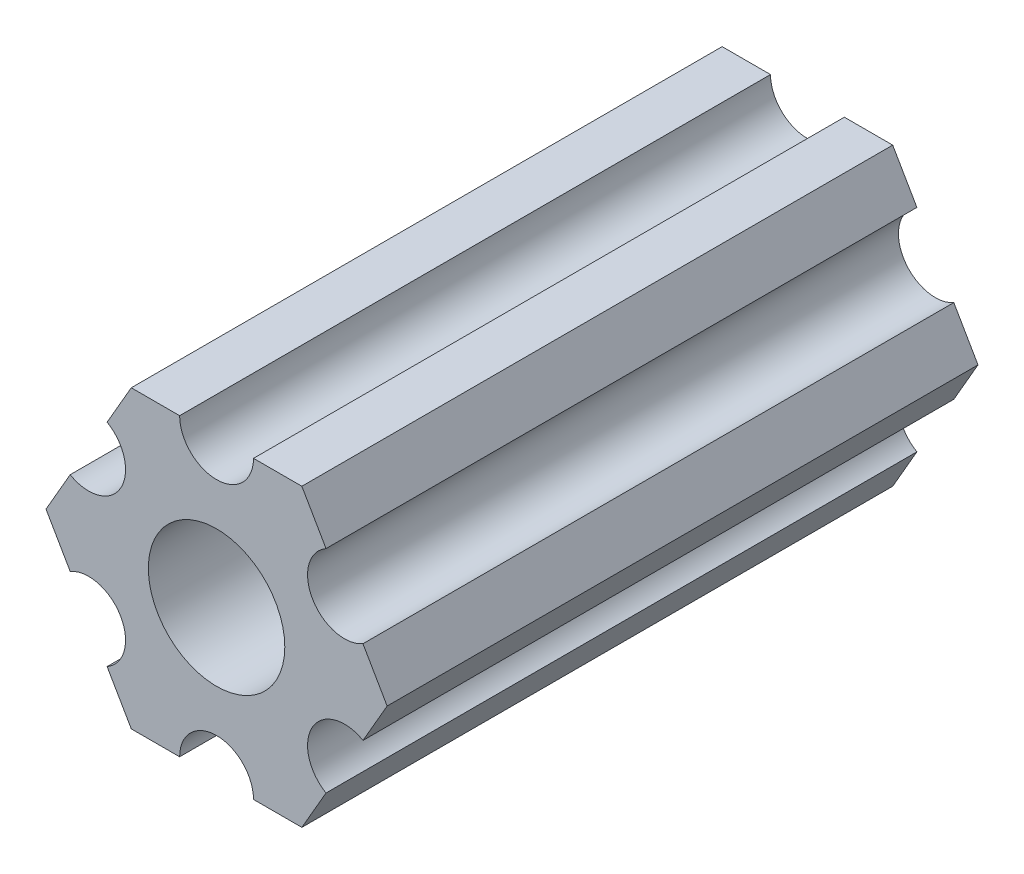
ISO-10303-21;
HEADER;
FILE_DESCRIPTION(('STEP AP214'),'2;1');
FILE_NAME('part.step','',(''),(''),'','','');
FILE_SCHEMA(('AUTOMOTIVE_DESIGN { 1 0 10303 214 1 1 1 1 }'));
ENDSEC;
DATA;
#1=APPLICATION_CONTEXT('core data for automotive mechanical design processes');
#2=APPLICATION_PROTOCOL_DEFINITION('international standard','automotive_design',2000,#1);
#3=PRODUCT_CONTEXT('',#1,'mechanical');
#4=PRODUCT('Part','Part','',(#3));
#5=PRODUCT_RELATED_PRODUCT_CATEGORY('part','',(#4));
#6=PRODUCT_DEFINITION_FORMATION('','',#4);
#7=PRODUCT_DEFINITION_CONTEXT('part definition',#1,'design');
#8=PRODUCT_DEFINITION('design','',#6,#7);
#9=PRODUCT_DEFINITION_SHAPE('','',#8);
#10=(LENGTH_UNIT() NAMED_UNIT(*) SI_UNIT(.MILLI.,.METRE.));
#11=(NAMED_UNIT(*) PLANE_ANGLE_UNIT() SI_UNIT($,.RADIAN.));
#12=(NAMED_UNIT(*) SI_UNIT($,.STERADIAN.) SOLID_ANGLE_UNIT());
#13=UNCERTAINTY_MEASURE_WITH_UNIT(LENGTH_MEASURE(1.E-05),#10,'distance_accuracy_value','');
#14=(GEOMETRIC_REPRESENTATION_CONTEXT(3) GLOBAL_UNCERTAINTY_ASSIGNED_CONTEXT((#13)) GLOBAL_UNIT_ASSIGNED_CONTEXT((#10,
#11,#12)) REPRESENTATION_CONTEXT('',''));
#15=CARTESIAN_POINT('',(0.,0.,0.));
#16=DIRECTION('',(0.,0.,1.));
#17=DIRECTION('',(1.,0.,0.));
#18=AXIS2_PLACEMENT_3D('',#15,#16,#17);
#19=CARTESIAN_POINT('',(4.70551131403118,4.5498153285078,-25.4));
#20=DIRECTION('',(0.866025403784438,0.500000000000001,0.));
#21=DIRECTION('',(-0.500000000000001,0.866025403784438,0.));
#22=AXIS2_PLACEMENT_3D('',#19,#20,#21);
#23=PLANE('',#22);
#24=DIRECTION('',(-0.500000000000001,0.866025403784438,0.));
#25=VECTOR('',#24,1.);
#26=CARTESIAN_POINT('',(4.70551131403118,4.5498153285078,0.));
#27=LINE('',#26,#25);
#28=CARTESIAN_POINT('',(4.70551131403118,4.5498153285078,0.));
#29=VERTEX_POINT('',#28);
#30=CARTESIAN_POINT('',(3.66617420935412,6.35,0.));
#31=VERTEX_POINT('',#30);
#32=EDGE_CURVE('E198',#29,#31,#27,.T.);
#33=ORIENTED_EDGE('',*,*,#32,.F.);
#34=DIRECTION('',(0.,0.,1.));
#35=VECTOR('',#34,1.);
#36=CARTESIAN_POINT('',(4.70551131403118,4.5498153285078,-25.4));
#37=LINE('',#36,#35);
#38=CARTESIAN_POINT('',(4.70551131403118,4.5498153285078,-25.4));
#39=VERTEX_POINT('',#38);
#40=EDGE_CURVE('E11',#39,#29,#37,.T.);
#41=ORIENTED_EDGE('',*,*,#40,.F.);
#42=DIRECTION('',(-0.500000000000001,0.866025403784438,0.));
#43=VECTOR('',#42,1.);
#44=CARTESIAN_POINT('',(4.70551131403118,4.5498153285078,-25.4));
#45=LINE('',#44,#43);
#46=CARTESIAN_POINT('',(3.66617420935412,6.35,-25.4));
#47=VERTEX_POINT('',#46);
#48=EDGE_CURVE('E249',#39,#47,#45,.T.);
#49=ORIENTED_EDGE('',*,*,#48,.T.);
#50=DIRECTION('',(0.,0.,1.));
#51=VECTOR('',#50,1.);
#52=CARTESIAN_POINT('',(3.66617420935412,6.35,-25.4));
#53=LINE('',#52,#51);
#54=EDGE_CURVE('E44',#47,#31,#53,.T.);
#55=ORIENTED_EDGE('',*,*,#54,.T.);
#56=EDGE_LOOP('',(#33,#41,#49,#55));
#57=FACE_BOUND('',#56,.T.);
#58=ADVANCED_FACE('F41',(#57),#23,.T.);
#59=CARTESIAN_POINT('',(5.49926131403118,3.175,-25.4));
#60=DIRECTION('',(0.,0.,1.));
#61=DIRECTION('',(1.,0.,0.));
#62=AXIS2_PLACEMENT_3D('',#59,#60,#61);
#63=CYLINDRICAL_SURFACE('',#62,1.5875);
#64=CARTESIAN_POINT('',(5.49926131403118,3.175,0.));
#65=DIRECTION('',(0.,0.,-1.));
#66=DIRECTION('',(1.,0.,0.));
#67=AXIS2_PLACEMENT_3D('',#64,#65,#66);
#68=CIRCLE('',#67,1.5875);
#69=CARTESIAN_POINT('',(6.29301131403118,1.8001846714922,0.));
#70=VERTEX_POINT('',#69);
#71=EDGE_CURVE('E247',#70,#29,#68,.T.);
#72=ORIENTED_EDGE('',*,*,#71,.F.);
#73=DIRECTION('',(0.,0.,1.));
#74=VECTOR('',#73,1.);
#75=CARTESIAN_POINT('',(6.29301131403118,1.8001846714922,-25.4));
#76=LINE('',#75,#74);
#77=CARTESIAN_POINT('',(6.29301131403118,1.8001846714922,-25.4));
#78=VERTEX_POINT('',#77);
#79=EDGE_CURVE('E50',#78,#70,#76,.T.);
#80=ORIENTED_EDGE('',*,*,#79,.F.);
#81=CARTESIAN_POINT('',(5.49926131403118,3.175,-25.4));
#82=DIRECTION('',(0.,0.,-1.));
#83=DIRECTION('',(1.,0.,0.));
#84=AXIS2_PLACEMENT_3D('',#81,#82,#83);
#85=CIRCLE('',#84,1.5875);
#86=EDGE_CURVE('E188',#78,#39,#85,.T.);
#87=ORIENTED_EDGE('',*,*,#86,.T.);
#88=ORIENTED_EDGE('',*,*,#40,.T.);
#89=EDGE_LOOP('',(#72,#80,#87,#88));
#90=FACE_BOUND('',#89,.T.);
#91=ADVANCED_FACE('F281',(#90),#63,.F.);
#92=CARTESIAN_POINT('',(7.33234841870824,0.,-25.4));
#93=DIRECTION('',(0.866025403784439,0.499999999999999,0.));
#94=DIRECTION('',(-0.499999999999999,0.866025403784439,0.));
#95=AXIS2_PLACEMENT_3D('',#92,#93,#94);
#96=PLANE('',#95);
#97=DIRECTION('',(-0.499999999999999,0.866025403784439,0.));
#98=VECTOR('',#97,1.);
#99=CARTESIAN_POINT('',(7.33234841870824,0.,0.));
#100=LINE('',#99,#98);
#101=CARTESIAN_POINT('',(7.33234841870824,0.,0.));
#102=VERTEX_POINT('',#101);
#103=EDGE_CURVE('E175',#102,#70,#100,.T.);
#104=ORIENTED_EDGE('',*,*,#103,.F.);
#105=DIRECTION('',(0.,0.,1.));
#106=VECTOR('',#105,1.);
#107=CARTESIAN_POINT('',(7.33234841870824,0.,-25.4));
#108=LINE('',#107,#106);
#109=CARTESIAN_POINT('',(7.33234841870824,0.,-25.4));
#110=VERTEX_POINT('',#109);
#111=EDGE_CURVE('E170',#110,#102,#108,.T.);
#112=ORIENTED_EDGE('',*,*,#111,.F.);
#113=DIRECTION('',(-0.499999999999999,0.866025403784439,0.));
#114=VECTOR('',#113,1.);
#115=CARTESIAN_POINT('',(7.33234841870824,0.,-25.4));
#116=LINE('',#115,#114);
#117=EDGE_CURVE('E173',#110,#78,#116,.T.);
#118=ORIENTED_EDGE('',*,*,#117,.T.);
#119=ORIENTED_EDGE('',*,*,#79,.T.);
#120=EDGE_LOOP('',(#104,#112,#118,#119));
#121=FACE_BOUND('',#120,.T.);
#122=ADVANCED_FACE('F172',(#121),#96,.T.);
#123=CARTESIAN_POINT('',(6.29301131403119,-1.8001846714922,-25.4));
#124=DIRECTION('',(0.866025403784439,-0.499999999999999,0.));
#125=DIRECTION('',(0.499999999999999,0.86602540378444,0.));
#126=AXIS2_PLACEMENT_3D('',#123,#124,#125);
#127=PLANE('',#126);
#128=DIRECTION('',(0.499999999999999,0.866025403784439,0.));
#129=VECTOR('',#128,1.);
#130=CARTESIAN_POINT('',(6.29301131403119,-1.8001846714922,0.));
#131=LINE('',#130,#129);
#132=CARTESIAN_POINT('',(6.29301131403119,-1.8001846714922,0.));
#133=VERTEX_POINT('',#132);
#134=EDGE_CURVE('E244',#133,#102,#131,.T.);
#135=ORIENTED_EDGE('',*,*,#134,.F.);
#136=DIRECTION('',(0.,0.,1.));
#137=VECTOR('',#136,1.);
#138=CARTESIAN_POINT('',(6.29301131403119,-1.8001846714922,-25.4));
#139=LINE('',#138,#137);
#140=CARTESIAN_POINT('',(6.29301131403119,-1.8001846714922,-25.4));
#141=VERTEX_POINT('',#140);
#142=EDGE_CURVE('E180',#141,#133,#139,.T.);
#143=ORIENTED_EDGE('',*,*,#142,.F.);
#144=DIRECTION('',(0.499999999999999,0.866025403784439,0.));
#145=VECTOR('',#144,1.);
#146=CARTESIAN_POINT('',(6.29301131403119,-1.8001846714922,-25.4));
#147=LINE('',#146,#145);
#148=EDGE_CURVE('E186',#141,#110,#147,.T.);
#149=ORIENTED_EDGE('',*,*,#148,.T.);
#150=ORIENTED_EDGE('',*,*,#111,.T.);
#151=EDGE_LOOP('',(#135,#143,#149,#150));
#152=FACE_BOUND('',#151,.T.);
#153=ADVANCED_FACE('F190',(#152),#127,.T.);
#154=CARTESIAN_POINT('',(5.49926131403118,-3.175,-25.4));
#155=DIRECTION('',(0.,0.,1.));
#156=DIRECTION('',(1.,0.,0.));
#157=AXIS2_PLACEMENT_3D('',#154,#155,#156);
#158=CYLINDRICAL_SURFACE('',#157,1.5875);
#159=CARTESIAN_POINT('',(5.49926131403118,-3.175,0.));
#160=DIRECTION('',(0.,0.,-1.));
#161=DIRECTION('',(1.,0.,0.));
#162=AXIS2_PLACEMENT_3D('',#159,#160,#161);
#163=CIRCLE('',#162,1.5875);
#164=CARTESIAN_POINT('',(4.70551131403118,-4.54981532850779,0.));
#165=VERTEX_POINT('',#164);
#166=EDGE_CURVE('E241',#165,#133,#163,.T.);
#167=ORIENTED_EDGE('',*,*,#166,.F.);
#168=DIRECTION('',(0.,0.,1.));
#169=VECTOR('',#168,1.);
#170=CARTESIAN_POINT('',(4.70551131403118,-4.54981532850779,-25.4));
#171=LINE('',#170,#169);
#172=CARTESIAN_POINT('',(4.70551131403118,-4.54981532850779,-25.4));
#173=VERTEX_POINT('',#172);
#174=EDGE_CURVE('E253',#173,#165,#171,.T.);
#175=ORIENTED_EDGE('',*,*,#174,.F.);
#176=CARTESIAN_POINT('',(5.49926131403118,-3.175,-25.4));
#177=DIRECTION('',(0.,0.,-1.));
#178=DIRECTION('',(1.,0.,0.));
#179=AXIS2_PLACEMENT_3D('',#176,#177,#178);
#180=CIRCLE('',#179,1.5875);
#181=EDGE_CURVE('E191',#173,#141,#180,.T.);
#182=ORIENTED_EDGE('',*,*,#181,.T.);
#183=ORIENTED_EDGE('',*,*,#142,.T.);
#184=EDGE_LOOP('',(#167,#175,#182,#183));
#185=FACE_BOUND('',#184,.T.);
#186=ADVANCED_FACE('F294',(#185),#158,.F.);
#187=CARTESIAN_POINT('',(3.66617420935412,-6.35,-25.4));
#188=DIRECTION('',(0.866025403784439,-0.499999999999998,0.));
#189=DIRECTION('',(0.499999999999999,0.86602540378444,0.));
#190=AXIS2_PLACEMENT_3D('',#187,#188,#189);
#191=PLANE('',#190);
#192=DIRECTION('',(0.499999999999998,0.866025403784439,0.));
#193=VECTOR('',#192,1.);
#194=CARTESIAN_POINT('',(3.66617420935412,-6.35,0.));
#195=LINE('',#194,#193);
#196=CARTESIAN_POINT('',(3.66617420935412,-6.35,0.));
#197=VERTEX_POINT('',#196);
#198=EDGE_CURVE('E238',#197,#165,#195,.T.);
#199=ORIENTED_EDGE('',*,*,#198,.F.);
#200=DIRECTION('',(0.,0.,1.));
#201=VECTOR('',#200,1.);
#202=CARTESIAN_POINT('',(3.66617420935412,-6.35,-25.4));
#203=LINE('',#202,#201);
#204=CARTESIAN_POINT('',(3.66617420935412,-6.35,-25.4));
#205=VERTEX_POINT('',#204);
#206=EDGE_CURVE('E255',#205,#197,#203,.T.);
#207=ORIENTED_EDGE('',*,*,#206,.F.);
#208=DIRECTION('',(0.499999999999998,0.866025403784439,0.));
#209=VECTOR('',#208,1.);
#210=CARTESIAN_POINT('',(3.66617420935412,-6.35,-25.4));
#211=LINE('',#210,#209);
#212=EDGE_CURVE('E193',#205,#173,#211,.T.);
#213=ORIENTED_EDGE('',*,*,#212,.T.);
#214=ORIENTED_EDGE('',*,*,#174,.T.);
#215=EDGE_LOOP('',(#199,#207,#213,#214));
#216=FACE_BOUND('',#215,.T.);
#217=ADVANCED_FACE('F297',(#216),#191,.T.);
#218=CARTESIAN_POINT('',(1.5875,-6.35,-25.4));
#219=DIRECTION('',(0.,-1.,0.));
#220=DIRECTION('',(1.,0.,0.));
#221=AXIS2_PLACEMENT_3D('',#218,#219,#220);
#222=PLANE('',#221);
#223=DIRECTION('',(1.,0.,0.));
#224=VECTOR('',#223,1.);
#225=CARTESIAN_POINT('',(1.5875,-6.35,0.));
#226=LINE('',#225,#224);
#227=CARTESIAN_POINT('',(1.5875,-6.35,0.));
#228=VERTEX_POINT('',#227);
#229=EDGE_CURVE('E235',#228,#197,#226,.T.);
#230=ORIENTED_EDGE('',*,*,#229,.F.);
#231=DIRECTION('',(0.,0.,1.));
#232=VECTOR('',#231,1.);
#233=CARTESIAN_POINT('',(1.5875,-6.35,-25.4));
#234=LINE('',#233,#232);
#235=CARTESIAN_POINT('',(1.5875,-6.35,-25.4));
#236=VERTEX_POINT('',#235);
#237=EDGE_CURVE('E257',#236,#228,#234,.T.);
#238=ORIENTED_EDGE('',*,*,#237,.F.);
#239=DIRECTION('',(1.,0.,0.));
#240=VECTOR('',#239,1.);
#241=CARTESIAN_POINT('',(1.5875,-6.35,-25.4));
#242=LINE('',#241,#240);
#243=EDGE_CURVE('E402',#236,#205,#242,.T.);
#244=ORIENTED_EDGE('',*,*,#243,.T.);
#245=ORIENTED_EDGE('',*,*,#206,.T.);
#246=EDGE_LOOP('',(#230,#238,#244,#245));
#247=FACE_BOUND('',#246,.T.);
#248=ADVANCED_FACE('F301',(#247),#222,.T.);
#249=CARTESIAN_POINT('',(0.,-6.35,-25.4));
#250=DIRECTION('',(0.,0.,1.));
#251=DIRECTION('',(1.,0.,0.));
#252=AXIS2_PLACEMENT_3D('',#249,#250,#251);
#253=CYLINDRICAL_SURFACE('',#252,1.5875);
#254=CARTESIAN_POINT('',(0.,-6.35,0.));
#255=DIRECTION('',(0.,0.,-1.));
#256=DIRECTION('',(1.,0.,0.));
#257=AXIS2_PLACEMENT_3D('',#254,#255,#256);
#258=CIRCLE('',#257,1.5875);
#259=CARTESIAN_POINT('',(-1.5875,-6.35,0.));
#260=VERTEX_POINT('',#259);
#261=EDGE_CURVE('E232',#260,#228,#258,.T.);
#262=ORIENTED_EDGE('',*,*,#261,.F.);
#263=DIRECTION('',(0.,0.,1.));
#264=VECTOR('',#263,1.);
#265=CARTESIAN_POINT('',(-1.5875,-6.35,-25.4));
#266=LINE('',#265,#264);
#267=CARTESIAN_POINT('',(-1.5875,-6.35,-25.4));
#268=VERTEX_POINT('',#267);
#269=EDGE_CURVE('E259',#268,#260,#266,.T.);
#270=ORIENTED_EDGE('',*,*,#269,.F.);
#271=CARTESIAN_POINT('',(0.,-6.35,-25.4));
#272=DIRECTION('',(0.,0.,-1.));
#273=DIRECTION('',(1.,0.,0.));
#274=AXIS2_PLACEMENT_3D('',#271,#272,#273);
#275=CIRCLE('',#274,1.5875);
#276=EDGE_CURVE('E399',#268,#236,#275,.T.);
#277=ORIENTED_EDGE('',*,*,#276,.T.);
#278=ORIENTED_EDGE('',*,*,#237,.T.);
#279=EDGE_LOOP('',(#262,#270,#277,#278));
#280=FACE_BOUND('',#279,.T.);
#281=ADVANCED_FACE('F305',(#280),#253,.F.);
#282=CARTESIAN_POINT('',(-3.66617420935412,-6.35,-25.4));
#283=DIRECTION('',(0.,-1.,0.));
#284=DIRECTION('',(1.,0.,0.));
#285=AXIS2_PLACEMENT_3D('',#282,#283,#284);
#286=PLANE('',#285);
#287=DIRECTION('',(1.,0.,0.));
#288=VECTOR('',#287,1.);
#289=CARTESIAN_POINT('',(-3.66617420935412,-6.35,0.));
#290=LINE('',#289,#288);
#291=CARTESIAN_POINT('',(-3.66617420935412,-6.35,0.));
#292=VERTEX_POINT('',#291);
#293=EDGE_CURVE('E229',#292,#260,#290,.T.);
#294=ORIENTED_EDGE('',*,*,#293,.F.);
#295=DIRECTION('',(0.,0.,1.));
#296=VECTOR('',#295,1.);
#297=CARTESIAN_POINT('',(-3.66617420935412,-6.35,-25.4));
#298=LINE('',#297,#296);
#299=CARTESIAN_POINT('',(-3.66617420935412,-6.35,-25.4));
#300=VERTEX_POINT('',#299);
#301=EDGE_CURVE('E261',#300,#292,#298,.T.);
#302=ORIENTED_EDGE('',*,*,#301,.F.);
#303=DIRECTION('',(1.,0.,0.));
#304=VECTOR('',#303,1.);
#305=CARTESIAN_POINT('',(-3.66617420935412,-6.35,-25.4));
#306=LINE('',#305,#304);
#307=EDGE_CURVE('E396',#300,#268,#306,.T.);
#308=ORIENTED_EDGE('',*,*,#307,.T.);
#309=ORIENTED_EDGE('',*,*,#269,.T.);
#310=EDGE_LOOP('',(#294,#302,#308,#309));
#311=FACE_BOUND('',#310,.T.);
#312=ADVANCED_FACE('F309',(#311),#286,.T.);
#313=CARTESIAN_POINT('',(-4.70551131403118,-4.5498153285078,-25.4));
#314=DIRECTION('',(-0.866025403784438,-0.500000000000001,0.));
#315=DIRECTION('',(0.500000000000001,-0.866025403784438,0.));
#316=AXIS2_PLACEMENT_3D('',#313,#314,#315);
#317=PLANE('',#316);
#318=DIRECTION('',(0.500000000000001,-0.866025403784438,0.));
#319=VECTOR('',#318,1.);
#320=CARTESIAN_POINT('',(-4.70551131403118,-4.5498153285078,0.));
#321=LINE('',#320,#319);
#322=CARTESIAN_POINT('',(-4.70551131403118,-4.5498153285078,0.));
#323=VERTEX_POINT('',#322);
#324=EDGE_CURVE('E226',#323,#292,#321,.T.);
#325=ORIENTED_EDGE('',*,*,#324,.F.);
#326=DIRECTION('',(0.,0.,1.));
#327=VECTOR('',#326,1.);
#328=CARTESIAN_POINT('',(-4.70551131403118,-4.5498153285078,-25.4));
#329=LINE('',#328,#327);
#330=CARTESIAN_POINT('',(-4.70551131403118,-4.5498153285078,-25.4));
#331=VERTEX_POINT('',#330);
#332=EDGE_CURVE('E263',#331,#323,#329,.T.);
#333=ORIENTED_EDGE('',*,*,#332,.F.);
#334=DIRECTION('',(0.500000000000001,-0.866025403784438,0.));
#335=VECTOR('',#334,1.);
#336=CARTESIAN_POINT('',(-4.70551131403118,-4.5498153285078,-25.4));
#337=LINE('',#336,#335);
#338=EDGE_CURVE('E393',#331,#300,#337,.T.);
#339=ORIENTED_EDGE('',*,*,#338,.T.);
#340=ORIENTED_EDGE('',*,*,#301,.T.);
#341=EDGE_LOOP('',(#325,#333,#339,#340));
#342=FACE_BOUND('',#341,.T.);
#343=ADVANCED_FACE('F313',(#342),#317,.T.);
#344=CARTESIAN_POINT('',(-5.49926131403118,-3.175,-25.4));
#345=DIRECTION('',(0.,0.,1.));
#346=DIRECTION('',(1.,0.,0.));
#347=AXIS2_PLACEMENT_3D('',#344,#345,#346);
#348=CYLINDRICAL_SURFACE('',#347,1.5875);
#349=CARTESIAN_POINT('',(-5.49926131403118,-3.175,0.));
#350=DIRECTION('',(0.,0.,-1.));
#351=DIRECTION('',(1.,0.,0.));
#352=AXIS2_PLACEMENT_3D('',#349,#350,#351);
#353=CIRCLE('',#352,1.5875);
#354=CARTESIAN_POINT('',(-6.29301131403118,-1.80018467149221,0.));
#355=VERTEX_POINT('',#354);
#356=EDGE_CURVE('E223',#355,#323,#353,.T.);
#357=ORIENTED_EDGE('',*,*,#356,.F.);
#358=DIRECTION('',(0.,0.,1.));
#359=VECTOR('',#358,1.);
#360=CARTESIAN_POINT('',(-6.29301131403118,-1.80018467149221,-25.4));
#361=LINE('',#360,#359);
#362=CARTESIAN_POINT('',(-6.29301131403118,-1.80018467149221,-25.4));
#363=VERTEX_POINT('',#362);
#364=EDGE_CURVE('E265',#363,#355,#361,.T.);
#365=ORIENTED_EDGE('',*,*,#364,.F.);
#366=CARTESIAN_POINT('',(-5.49926131403118,-3.175,-25.4));
#367=DIRECTION('',(0.,0.,-1.));
#368=DIRECTION('',(1.,0.,0.));
#369=AXIS2_PLACEMENT_3D('',#366,#367,#368);
#370=CIRCLE('',#369,1.5875);
#371=EDGE_CURVE('E390',#363,#331,#370,.T.);
#372=ORIENTED_EDGE('',*,*,#371,.T.);
#373=ORIENTED_EDGE('',*,*,#332,.T.);
#374=EDGE_LOOP('',(#357,#365,#372,#373));
#375=FACE_BOUND('',#374,.T.);
#376=ADVANCED_FACE('F317',(#375),#348,.F.);
#377=CARTESIAN_POINT('',(-7.33234841870824,0.,-25.4));
#378=DIRECTION('',(-0.866025403784439,-0.499999999999999,0.));
#379=DIRECTION('',(0.499999999999999,-0.866025403784439,0.));
#380=AXIS2_PLACEMENT_3D('',#377,#378,#379);
#381=PLANE('',#380);
#382=DIRECTION('',(0.499999999999999,-0.866025403784439,0.));
#383=VECTOR('',#382,1.);
#384=CARTESIAN_POINT('',(-7.33234841870824,0.,0.));
#385=LINE('',#384,#383);
#386=CARTESIAN_POINT('',(-7.33234841870824,0.,0.));
#387=VERTEX_POINT('',#386);
#388=EDGE_CURVE('E220',#387,#355,#385,.T.);
#389=ORIENTED_EDGE('',*,*,#388,.F.);
#390=DIRECTION('',(0.,0.,1.));
#391=VECTOR('',#390,1.);
#392=CARTESIAN_POINT('',(-7.33234841870824,0.,-25.4));
#393=LINE('',#392,#391);
#394=CARTESIAN_POINT('',(-7.33234841870824,0.,-25.4));
#395=VERTEX_POINT('',#394);
#396=EDGE_CURVE('E267',#395,#387,#393,.T.);
#397=ORIENTED_EDGE('',*,*,#396,.F.);
#398=DIRECTION('',(0.499999999999999,-0.866025403784439,0.));
#399=VECTOR('',#398,1.);
#400=CARTESIAN_POINT('',(-7.33234841870824,0.,-25.4));
#401=LINE('',#400,#399);
#402=EDGE_CURVE('E387',#395,#363,#401,.T.);
#403=ORIENTED_EDGE('',*,*,#402,.T.);
#404=ORIENTED_EDGE('',*,*,#364,.T.);
#405=EDGE_LOOP('',(#389,#397,#403,#404));
#406=FACE_BOUND('',#405,.T.);
#407=ADVANCED_FACE('F321',(#406),#381,.T.);
#408=CARTESIAN_POINT('',(-6.29301131403119,1.8001846714922,-25.4));
#409=DIRECTION('',(-0.86602540378444,0.499999999999998,0.));
#410=DIRECTION('',(-0.499999999999998,-0.86602540378444,0.));
#411=AXIS2_PLACEMENT_3D('',#408,#409,#410);
#412=PLANE('',#411);
#413=DIRECTION('',(-0.499999999999998,-0.86602540378444,0.));
#414=VECTOR('',#413,1.);
#415=CARTESIAN_POINT('',(-6.29301131403119,1.8001846714922,0.));
#416=LINE('',#415,#414);
#417=CARTESIAN_POINT('',(-6.29301131403119,1.8001846714922,0.));
#418=VERTEX_POINT('',#417);
#419=EDGE_CURVE('E217',#418,#387,#416,.T.);
#420=ORIENTED_EDGE('',*,*,#419,.F.);
#421=DIRECTION('',(0.,0.,1.));
#422=VECTOR('',#421,1.);
#423=CARTESIAN_POINT('',(-6.29301131403119,1.8001846714922,-25.4));
#424=LINE('',#423,#422);
#425=CARTESIAN_POINT('',(-6.29301131403119,1.8001846714922,-25.4));
#426=VERTEX_POINT('',#425);
#427=EDGE_CURVE('E269',#426,#418,#424,.T.);
#428=ORIENTED_EDGE('',*,*,#427,.F.);
#429=DIRECTION('',(-0.499999999999998,-0.86602540378444,0.));
#430=VECTOR('',#429,1.);
#431=CARTESIAN_POINT('',(-6.29301131403119,1.8001846714922,-25.4));
#432=LINE('',#431,#430);
#433=EDGE_CURVE('E384',#426,#395,#432,.T.);
#434=ORIENTED_EDGE('',*,*,#433,.T.);
#435=ORIENTED_EDGE('',*,*,#396,.T.);
#436=EDGE_LOOP('',(#420,#428,#434,#435));
#437=FACE_BOUND('',#436,.T.);
#438=ADVANCED_FACE('F325',(#437),#412,.T.);
#439=CARTESIAN_POINT('',(-5.49926131403119,3.17499999999999,-25.4));
#440=DIRECTION('',(0.,0.,1.));
#441=DIRECTION('',(1.,0.,0.));
#442=AXIS2_PLACEMENT_3D('',#439,#440,#441);
#443=CYLINDRICAL_SURFACE('',#442,1.5875);
#444=CARTESIAN_POINT('',(-5.49926131403119,3.17499999999999,0.));
#445=DIRECTION('',(0.,0.,-1.));
#446=DIRECTION('',(1.,0.,0.));
#447=AXIS2_PLACEMENT_3D('',#444,#445,#446);
#448=CIRCLE('',#447,1.5875);
#449=CARTESIAN_POINT('',(-4.70551131403119,4.54981532850779,0.));
#450=VERTEX_POINT('',#449);
#451=EDGE_CURVE('E214',#450,#418,#448,.T.);
#452=ORIENTED_EDGE('',*,*,#451,.F.);
#453=DIRECTION('',(0.,0.,1.));
#454=VECTOR('',#453,1.);
#455=CARTESIAN_POINT('',(-4.70551131403119,4.54981532850779,-25.4));
#456=LINE('',#455,#454);
#457=CARTESIAN_POINT('',(-4.70551131403119,4.54981532850779,-25.4));
#458=VERTEX_POINT('',#457);
#459=EDGE_CURVE('E271',#458,#450,#456,.T.);
#460=ORIENTED_EDGE('',*,*,#459,.F.);
#461=CARTESIAN_POINT('',(-5.49926131403119,3.17499999999999,-25.4));
#462=DIRECTION('',(0.,0.,-1.));
#463=DIRECTION('',(1.,0.,0.));
#464=AXIS2_PLACEMENT_3D('',#461,#462,#463);
#465=CIRCLE('',#464,1.5875);
#466=EDGE_CURVE('E381',#458,#426,#465,.T.);
#467=ORIENTED_EDGE('',*,*,#466,.T.);
#468=ORIENTED_EDGE('',*,*,#427,.T.);
#469=EDGE_LOOP('',(#452,#460,#467,#468));
#470=FACE_BOUND('',#469,.T.);
#471=ADVANCED_FACE('F329',(#470),#443,.F.);
#472=CARTESIAN_POINT('',(-3.66617420935412,6.35,-25.4));
#473=DIRECTION('',(-0.866025403784438,0.5,0.));
#474=DIRECTION('',(-0.5,-0.866025403784439,0.));
#475=AXIS2_PLACEMENT_3D('',#472,#473,#474);
#476=PLANE('',#475);
#477=DIRECTION('',(-0.5,-0.866025403784439,0.));
#478=VECTOR('',#477,1.);
#479=CARTESIAN_POINT('',(-3.66617420935412,6.35,0.));
#480=LINE('',#479,#478);
#481=CARTESIAN_POINT('',(-3.66617420935412,6.35,0.));
#482=VERTEX_POINT('',#481);
#483=EDGE_CURVE('E211',#482,#450,#480,.T.);
#484=ORIENTED_EDGE('',*,*,#483,.F.);
#485=DIRECTION('',(0.,0.,1.));
#486=VECTOR('',#485,1.);
#487=CARTESIAN_POINT('',(-3.66617420935412,6.35,-25.4));
#488=LINE('',#487,#486);
#489=CARTESIAN_POINT('',(-3.66617420935412,6.35,-25.4));
#490=VERTEX_POINT('',#489);
#491=EDGE_CURVE('E273',#490,#482,#488,.T.);
#492=ORIENTED_EDGE('',*,*,#491,.F.);
#493=DIRECTION('',(-0.5,-0.866025403784439,0.));
#494=VECTOR('',#493,1.);
#495=CARTESIAN_POINT('',(-3.66617420935412,6.35,-25.4));
#496=LINE('',#495,#494);
#497=EDGE_CURVE('E378',#490,#458,#496,.T.);
#498=ORIENTED_EDGE('',*,*,#497,.T.);
#499=ORIENTED_EDGE('',*,*,#459,.T.);
#500=EDGE_LOOP('',(#484,#492,#498,#499));
#501=FACE_BOUND('',#500,.T.);
#502=ADVANCED_FACE('F333',(#501),#476,.T.);
#503=CARTESIAN_POINT('',(-1.5875,6.35,-25.4));
#504=DIRECTION('',(0.,1.,0.));
#505=DIRECTION('',(-1.,0.,0.));
#506=AXIS2_PLACEMENT_3D('',#503,#504,#505);
#507=PLANE('',#506);
#508=DIRECTION('',(-1.,0.,0.));
#509=VECTOR('',#508,1.);
#510=CARTESIAN_POINT('',(-1.5875,6.35,0.));
#511=LINE('',#510,#509);
#512=CARTESIAN_POINT('',(-1.5875,6.35,0.));
#513=VERTEX_POINT('',#512);
#514=EDGE_CURVE('E208',#513,#482,#511,.T.);
#515=ORIENTED_EDGE('',*,*,#514,.F.);
#516=DIRECTION('',(0.,0.,1.));
#517=VECTOR('',#516,1.);
#518=CARTESIAN_POINT('',(-1.5875,6.35,-25.4));
#519=LINE('',#518,#517);
#520=CARTESIAN_POINT('',(-1.5875,6.35,-25.4));
#521=VERTEX_POINT('',#520);
#522=EDGE_CURVE('E275',#521,#513,#519,.T.);
#523=ORIENTED_EDGE('',*,*,#522,.F.);
#524=DIRECTION('',(-1.,0.,0.));
#525=VECTOR('',#524,1.);
#526=CARTESIAN_POINT('',(-1.5875,6.35,-25.4));
#527=LINE('',#526,#525);
#528=EDGE_CURVE('E375',#521,#490,#527,.T.);
#529=ORIENTED_EDGE('',*,*,#528,.T.);
#530=ORIENTED_EDGE('',*,*,#491,.T.);
#531=EDGE_LOOP('',(#515,#523,#529,#530));
#532=FACE_BOUND('',#531,.T.);
#533=ADVANCED_FACE('F337',(#532),#507,.T.);
#534=CARTESIAN_POINT('',(0.,6.35,-25.4));
#535=DIRECTION('',(0.,0.,1.));
#536=DIRECTION('',(1.,0.,0.));
#537=AXIS2_PLACEMENT_3D('',#534,#535,#536);
#538=CYLINDRICAL_SURFACE('',#537,1.5875);
#539=CARTESIAN_POINT('',(0.,6.35,0.));
#540=DIRECTION('',(0.,0.,-1.));
#541=DIRECTION('',(1.,0.,0.));
#542=AXIS2_PLACEMENT_3D('',#539,#540,#541);
#543=CIRCLE('',#542,1.5875);
#544=CARTESIAN_POINT('',(1.5875,6.35,0.));
#545=VERTEX_POINT('',#544);
#546=EDGE_CURVE('E205',#545,#513,#543,.T.);
#547=ORIENTED_EDGE('',*,*,#546,.F.);
#548=DIRECTION('',(0.,0.,1.));
#549=VECTOR('',#548,1.);
#550=CARTESIAN_POINT('',(1.5875,6.35,-25.4));
#551=LINE('',#550,#549);
#552=CARTESIAN_POINT('',(1.5875,6.35,-25.4));
#553=VERTEX_POINT('',#552);
#554=EDGE_CURVE('E276',#553,#545,#551,.T.);
#555=ORIENTED_EDGE('',*,*,#554,.F.);
#556=CARTESIAN_POINT('',(0.,6.35,-25.4));
#557=DIRECTION('',(0.,0.,-1.));
#558=DIRECTION('',(1.,0.,0.));
#559=AXIS2_PLACEMENT_3D('',#556,#557,#558);
#560=CIRCLE('',#559,1.5875);
#561=EDGE_CURVE('E372',#553,#521,#560,.T.);
#562=ORIENTED_EDGE('',*,*,#561,.T.);
#563=ORIENTED_EDGE('',*,*,#522,.T.);
#564=EDGE_LOOP('',(#547,#555,#562,#563));
#565=FACE_BOUND('',#564,.T.);
#566=ADVANCED_FACE('F341',(#565),#538,.F.);
#567=CARTESIAN_POINT('',(3.66617420935412,6.35,-25.4));
#568=DIRECTION('',(0.,1.,0.));
#569=DIRECTION('',(-1.,0.,0.));
#570=AXIS2_PLACEMENT_3D('',#567,#568,#569);
#571=PLANE('',#570);
#572=DIRECTION('',(-1.,0.,0.));
#573=VECTOR('',#572,1.);
#574=CARTESIAN_POINT('',(3.66617420935412,6.35,0.));
#575=LINE('',#574,#573);
#576=EDGE_CURVE('E201',#31,#545,#575,.T.);
#577=ORIENTED_EDGE('',*,*,#576,.F.);
#578=ORIENTED_EDGE('',*,*,#54,.F.);
#579=DIRECTION('',(-1.,0.,0.));
#580=VECTOR('',#579,1.);
#581=CARTESIAN_POINT('',(3.66617420935412,6.35,-25.4));
#582=LINE('',#581,#580);
#583=EDGE_CURVE('E370',#47,#553,#582,.T.);
#584=ORIENTED_EDGE('',*,*,#583,.T.);
#585=ORIENTED_EDGE('',*,*,#554,.T.);
#586=EDGE_LOOP('',(#577,#578,#584,#585));
#587=FACE_BOUND('',#586,.T.);
#588=ADVANCED_FACE('F278',(#587),#571,.T.);
#589=CARTESIAN_POINT('',(0.,6.35,-25.4));
#590=DIRECTION('',(0.,0.,1.));
#591=DIRECTION('',(1.,0.,0.));
#592=AXIS2_PLACEMENT_3D('',#589,#590,#591);
#593=PLANE('',#592);
#594=CARTESIAN_POINT('',(0.,0.,-25.4));
#595=DIRECTION('',(0.,0.,1.));
#596=DIRECTION('',(1.,0.,0.));
#597=AXIS2_PLACEMENT_3D('',#594,#595,#596);
#598=CIRCLE('',#597,2.9337);
#599=CARTESIAN_POINT('',(2.9337,0.,-25.4));
#600=VERTEX_POINT('',#599);
#601=EDGE_CURVE('E202',#600,#600,#598,.T.);
#602=ORIENTED_EDGE('',*,*,#601,.T.);
#603=EDGE_LOOP('',(#602));
#604=FACE_BOUND('',#603,.T.);
#605=ORIENTED_EDGE('',*,*,#48,.F.);
#606=ORIENTED_EDGE('',*,*,#86,.F.);
#607=ORIENTED_EDGE('',*,*,#117,.F.);
#608=ORIENTED_EDGE('',*,*,#148,.F.);
#609=ORIENTED_EDGE('',*,*,#181,.F.);
#610=ORIENTED_EDGE('',*,*,#212,.F.);
#611=ORIENTED_EDGE('',*,*,#243,.F.);
#612=ORIENTED_EDGE('',*,*,#276,.F.);
#613=ORIENTED_EDGE('',*,*,#307,.F.);
#614=ORIENTED_EDGE('',*,*,#338,.F.);
#615=ORIENTED_EDGE('',*,*,#371,.F.);
#616=ORIENTED_EDGE('',*,*,#402,.F.);
#617=ORIENTED_EDGE('',*,*,#433,.F.);
#618=ORIENTED_EDGE('',*,*,#466,.F.);
#619=ORIENTED_EDGE('',*,*,#497,.F.);
#620=ORIENTED_EDGE('',*,*,#528,.F.);
#621=ORIENTED_EDGE('',*,*,#561,.F.);
#622=ORIENTED_EDGE('',*,*,#583,.F.);
#623=EDGE_LOOP('',(#605,#606,#607,#608,#609,#610,#611,#612,#613,#614,#615,#616,#617,#618,#619,
#620,#621,#622));
#624=FACE_BOUND('',#623,.T.);
#625=ADVANCED_FACE('F184',(#604,#624),#593,.F.);
#626=CARTESIAN_POINT('',(0.,6.35,0.));
#627=DIRECTION('',(0.,0.,1.));
#628=DIRECTION('',(1.,0.,0.));
#629=AXIS2_PLACEMENT_3D('',#626,#627,#628);
#630=PLANE('',#629);
#631=CARTESIAN_POINT('',(0.,0.,0.));
#632=DIRECTION('',(0.,0.,1.));
#633=DIRECTION('',(1.,0.,0.));
#634=AXIS2_PLACEMENT_3D('',#631,#632,#633);
#635=CIRCLE('',#634,2.9337);
#636=CARTESIAN_POINT('',(2.9337,0.,0.));
#637=VERTEX_POINT('',#636);
#638=EDGE_CURVE('E365',#637,#637,#635,.T.);
#639=ORIENTED_EDGE('',*,*,#638,.F.);
#640=EDGE_LOOP('',(#639));
#641=FACE_BOUND('',#640,.T.);
#642=ORIENTED_EDGE('',*,*,#32,.T.);
#643=ORIENTED_EDGE('',*,*,#576,.T.);
#644=ORIENTED_EDGE('',*,*,#546,.T.);
#645=ORIENTED_EDGE('',*,*,#514,.T.);
#646=ORIENTED_EDGE('',*,*,#483,.T.);
#647=ORIENTED_EDGE('',*,*,#451,.T.);
#648=ORIENTED_EDGE('',*,*,#419,.T.);
#649=ORIENTED_EDGE('',*,*,#388,.T.);
#650=ORIENTED_EDGE('',*,*,#356,.T.);
#651=ORIENTED_EDGE('',*,*,#324,.T.);
#652=ORIENTED_EDGE('',*,*,#293,.T.);
#653=ORIENTED_EDGE('',*,*,#261,.T.);
#654=ORIENTED_EDGE('',*,*,#229,.T.);
#655=ORIENTED_EDGE('',*,*,#198,.T.);
#656=ORIENTED_EDGE('',*,*,#166,.T.);
#657=ORIENTED_EDGE('',*,*,#134,.T.);
#658=ORIENTED_EDGE('',*,*,#103,.T.);
#659=ORIENTED_EDGE('',*,*,#71,.T.);
#660=EDGE_LOOP('',(#642,#643,#644,#645,#646,#647,#648,#649,#650,#651,#652,#653,#654,#655,#656,
#657,#658,#659));
#661=FACE_BOUND('',#660,.T.);
#662=ADVANCED_FACE('F280',(#641,#661),#630,.T.);
#663=CARTESIAN_POINT('',(0.,0.,-25.4));
#664=DIRECTION('',(0.,0.,1.));
#665=DIRECTION('',(1.,0.,0.));
#666=AXIS2_PLACEMENT_3D('',#663,#664,#665);
#667=CYLINDRICAL_SURFACE('',#666,2.9337);
#668=ORIENTED_EDGE('',*,*,#601,.F.);
#669=EDGE_LOOP('',(#668));
#670=FACE_BOUND('',#669,.T.);
#671=ORIENTED_EDGE('',*,*,#638,.T.);
#672=EDGE_LOOP('',(#671));
#673=FACE_BOUND('',#672,.T.);
#674=ADVANCED_FACE('F353',(#670,#673),#667,.F.);
#675=CLOSED_SHELL('',(#58,#91,#122,#153,#186,#217,#248,#281,#312,#343,#376,#407,#438,#471,#502,
#533,#566,#588,#625,#662,#674));
#676=MANIFOLD_SOLID_BREP('B2',#675);
#677=ADVANCED_BREP_SHAPE_REPRESENTATION('',(#18,#676),#14);
#678=SHAPE_DEFINITION_REPRESENTATION(#9,#677);
ENDSEC;
END-ISO-10303-21;
